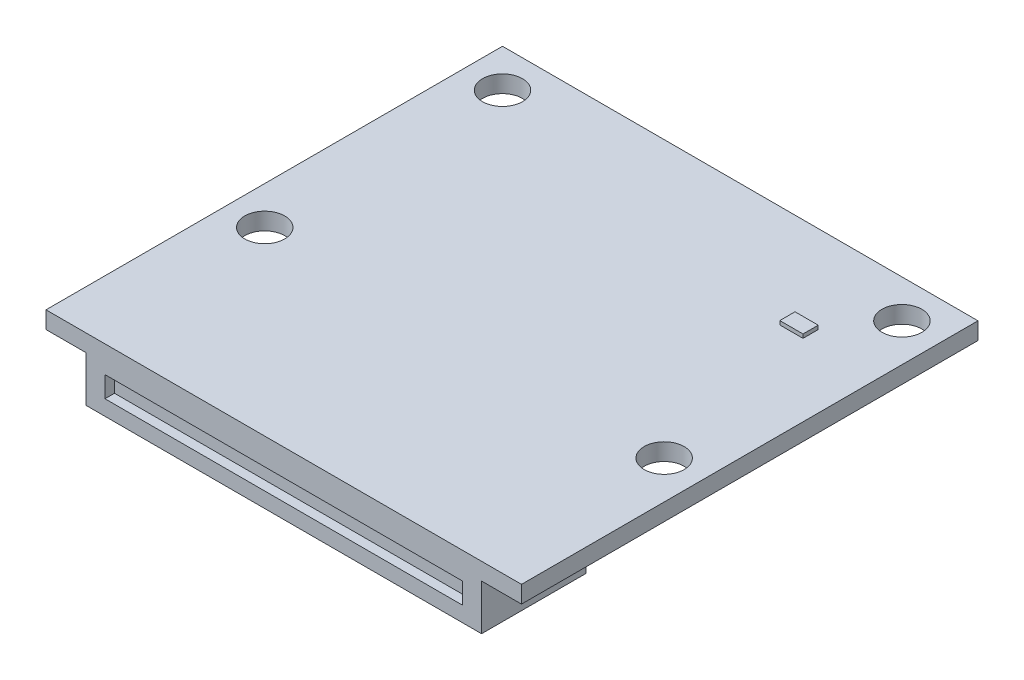
ISO-10303-21;
HEADER;
FILE_DESCRIPTION(('STEP AP214'),'2;1');
FILE_NAME('part.step','',(''),(''),'','','');
FILE_SCHEMA(('AUTOMOTIVE_DESIGN { 1 0 10303 214 1 1 1 1 }'));
ENDSEC;
DATA;
#1=APPLICATION_CONTEXT('core data for automotive mechanical design processes');
#2=APPLICATION_PROTOCOL_DEFINITION('international standard','automotive_design',2000,#1);
#3=PRODUCT_CONTEXT('',#1,'mechanical');
#4=PRODUCT('Part','Part','',(#3));
#5=PRODUCT_RELATED_PRODUCT_CATEGORY('part','',(#4));
#6=PRODUCT_DEFINITION_FORMATION('','',#4);
#7=PRODUCT_DEFINITION_CONTEXT('part definition',#1,'design');
#8=PRODUCT_DEFINITION('design','',#6,#7);
#9=PRODUCT_DEFINITION_SHAPE('','',#8);
#10=(LENGTH_UNIT() NAMED_UNIT(*) SI_UNIT(.MILLI.,.METRE.));
#11=(NAMED_UNIT(*) PLANE_ANGLE_UNIT() SI_UNIT($,.RADIAN.));
#12=(NAMED_UNIT(*) SI_UNIT($,.STERADIAN.) SOLID_ANGLE_UNIT());
#13=UNCERTAINTY_MEASURE_WITH_UNIT(LENGTH_MEASURE(1.E-05),#10,'distance_accuracy_value','');
#14=(GEOMETRIC_REPRESENTATION_CONTEXT(3) GLOBAL_UNCERTAINTY_ASSIGNED_CONTEXT((#13)) GLOBAL_UNIT_ASSIGNED_CONTEXT((#10,
#11,#12)) REPRESENTATION_CONTEXT('',''));
#15=CARTESIAN_POINT('',(0.,0.,0.));
#16=DIRECTION('',(0.,0.,1.));
#17=DIRECTION('',(1.,0.,0.));
#18=AXIS2_PLACEMENT_3D('',#15,#16,#17);
#19=CARTESIAN_POINT('',(0.,0.,0.));
#20=DIRECTION('',(0.,1.,0.));
#21=DIRECTION('',(0.,0.,1.));
#22=AXIS2_PLACEMENT_3D('',#19,#20,#21);
#23=PLANE('',#22);
#24=DIRECTION('',(0.,0.,1.));
#25=VECTOR('',#24,1.);
#26=CARTESIAN_POINT('',(-12.5,0.,-14.5));
#27=LINE('',#26,#25);
#28=CARTESIAN_POINT('',(-12.5,0.,-14.5));
#29=VERTEX_POINT('',#28);
#30=CARTESIAN_POINT('',(-12.5,0.,9.5));
#31=VERTEX_POINT('',#30);
#32=EDGE_CURVE('E272',#29,#31,#27,.T.);
#33=ORIENTED_EDGE('',*,*,#32,.T.);
#34=DIRECTION('',(1.,0.,0.));
#35=VECTOR('',#34,1.);
#36=CARTESIAN_POINT('',(-12.5,0.,9.5));
#37=LINE('',#36,#35);
#38=CARTESIAN_POINT('',(12.5,0.,9.5));
#39=VERTEX_POINT('',#38);
#40=EDGE_CURVE('E275',#31,#39,#37,.T.);
#41=ORIENTED_EDGE('',*,*,#40,.T.);
#42=DIRECTION('',(0.,0.,-1.));
#43=VECTOR('',#42,1.);
#44=CARTESIAN_POINT('',(12.5,0.,-14.5));
#45=LINE('',#44,#43);
#46=CARTESIAN_POINT('',(12.5,0.,-14.5));
#47=VERTEX_POINT('',#46);
#48=EDGE_CURVE('E279',#39,#47,#45,.T.);
#49=ORIENTED_EDGE('',*,*,#48,.T.);
#50=DIRECTION('',(-1.,0.,0.));
#51=VECTOR('',#50,1.);
#52=CARTESIAN_POINT('',(-12.5,0.,-14.5));
#53=LINE('',#52,#51);
#54=EDGE_CURVE('E282',#47,#29,#53,.T.);
#55=ORIENTED_EDGE('',*,*,#54,.T.);
#56=EDGE_LOOP('',(#33,#41,#49,#55));
#57=FACE_BOUND('',#56,.T.);
#58=CARTESIAN_POINT('',(10.5,0.,-12.5));
#59=DIRECTION('',(0.,1.,0.));
#60=DIRECTION('',(0.,0.,1.));
#61=AXIS2_PLACEMENT_3D('',#58,#59,#60);
#62=CIRCLE('',#61,1.05);
#63=CARTESIAN_POINT('',(10.5,0.,-11.45));
#64=VERTEX_POINT('',#63);
#65=EDGE_CURVE('E334',#64,#64,#62,.T.);
#66=ORIENTED_EDGE('',*,*,#65,.F.);
#67=EDGE_LOOP('',(#66));
#68=FACE_BOUND('',#67,.T.);
#69=CARTESIAN_POINT('',(10.5,0.,0.));
#70=DIRECTION('',(0.,1.,0.));
#71=DIRECTION('',(0.,0.,1.));
#72=AXIS2_PLACEMENT_3D('',#69,#70,#71);
#73=CIRCLE('',#72,1.05);
#74=CARTESIAN_POINT('',(10.5,0.,1.05));
#75=VERTEX_POINT('',#74);
#76=EDGE_CURVE('E328',#75,#75,#73,.T.);
#77=ORIENTED_EDGE('',*,*,#76,.F.);
#78=EDGE_LOOP('',(#77));
#79=FACE_BOUND('',#78,.T.);
#80=CARTESIAN_POINT('',(-10.5,0.,0.));
#81=DIRECTION('',(0.,1.,0.));
#82=DIRECTION('',(0.,0.,-1.));
#83=AXIS2_PLACEMENT_3D('',#80,#81,#82);
#84=CIRCLE('',#83,1.05);
#85=CARTESIAN_POINT('',(-10.5,0.,-1.05));
#86=VERTEX_POINT('',#85);
#87=EDGE_CURVE('E323',#86,#86,#84,.T.);
#88=ORIENTED_EDGE('',*,*,#87,.F.);
#89=EDGE_LOOP('',(#88));
#90=FACE_BOUND('',#89,.T.);
#91=CARTESIAN_POINT('',(-10.5,0.,-12.5));
#92=DIRECTION('',(0.,1.,0.));
#93=DIRECTION('',(0.,0.,-1.));
#94=AXIS2_PLACEMENT_3D('',#91,#92,#93);
#95=CIRCLE('',#94,1.05);
#96=CARTESIAN_POINT('',(-10.5,0.,-13.55));
#97=VERTEX_POINT('',#96);
#98=EDGE_CURVE('E317',#97,#97,#95,.T.);
#99=ORIENTED_EDGE('',*,*,#98,.F.);
#100=EDGE_LOOP('',(#99));
#101=FACE_BOUND('',#100,.T.);
#102=DIRECTION('',(-1.,0.,0.));
#103=VECTOR('',#102,1.);
#104=CARTESIAN_POINT('',(8.7,0.,-9.9));
#105=LINE('',#104,#103);
#106=CARTESIAN_POINT('',(8.7,0.,-9.9));
#107=VERTEX_POINT('',#106);
#108=CARTESIAN_POINT('',(7.48,0.,-9.9));
#109=VERTEX_POINT('',#108);
#110=EDGE_CURVE('E201',#107,#109,#105,.T.);
#111=ORIENTED_EDGE('',*,*,#110,.F.);
#112=DIRECTION('',(0.,0.,-1.));
#113=VECTOR('',#112,1.);
#114=CARTESIAN_POINT('',(8.7,0.,-9.1));
#115=LINE('',#114,#113);
#116=CARTESIAN_POINT('',(8.7,0.,-9.1));
#117=VERTEX_POINT('',#116);
#118=EDGE_CURVE('E184',#117,#107,#115,.T.);
#119=ORIENTED_EDGE('',*,*,#118,.F.);
#120=DIRECTION('',(1.,0.,0.));
#121=VECTOR('',#120,1.);
#122=CARTESIAN_POINT('',(8.7,0.,-9.1));
#123=LINE('',#122,#121);
#124=CARTESIAN_POINT('',(7.48,0.,-9.1));
#125=VERTEX_POINT('',#124);
#126=EDGE_CURVE('E192',#125,#117,#123,.T.);
#127=ORIENTED_EDGE('',*,*,#126,.F.);
#128=DIRECTION('',(0.,0.,1.));
#129=VECTOR('',#128,1.);
#130=CARTESIAN_POINT('',(7.48,0.,-9.1));
#131=LINE('',#130,#129);
#132=EDGE_CURVE('E203',#109,#125,#131,.T.);
#133=ORIENTED_EDGE('',*,*,#132,.F.);
#134=EDGE_LOOP('',(#111,#119,#127,#133));
#135=FACE_BOUND('',#134,.T.);
#136=ADVANCED_FACE('F34',(#57,#68,#79,#90,#101,#135),#23,.T.);
#137=CARTESIAN_POINT('',(0.,-0.9,0.));
#138=DIRECTION('',(0.,1.,0.));
#139=DIRECTION('',(0.,0.,1.));
#140=AXIS2_PLACEMENT_3D('',#137,#138,#139);
#141=PLANE('',#140);
#142=CARTESIAN_POINT('',(10.5,-0.9,-12.5));
#143=DIRECTION('',(0.,1.,0.));
#144=DIRECTION('',(0.,0.,1.));
#145=AXIS2_PLACEMENT_3D('',#142,#143,#144);
#146=CIRCLE('',#145,1.05);
#147=CARTESIAN_POINT('',(10.5,-0.9,-11.45));
#148=VERTEX_POINT('',#147);
#149=EDGE_CURVE('E276',#148,#148,#146,.T.);
#150=ORIENTED_EDGE('',*,*,#149,.T.);
#151=EDGE_LOOP('',(#150));
#152=FACE_BOUND('',#151,.T.);
#153=CARTESIAN_POINT('',(10.5,-0.9,0.));
#154=DIRECTION('',(0.,1.,0.));
#155=DIRECTION('',(0.,0.,1.));
#156=AXIS2_PLACEMENT_3D('',#153,#154,#155);
#157=CIRCLE('',#156,1.05);
#158=CARTESIAN_POINT('',(10.5,-0.9,1.05));
#159=VERTEX_POINT('',#158);
#160=EDGE_CURVE('E331',#159,#159,#157,.T.);
#161=ORIENTED_EDGE('',*,*,#160,.T.);
#162=EDGE_LOOP('',(#161));
#163=FACE_BOUND('',#162,.T.);
#164=CARTESIAN_POINT('',(-10.5,-0.9,0.));
#165=DIRECTION('',(0.,1.,0.));
#166=DIRECTION('',(0.,0.,-1.));
#167=AXIS2_PLACEMENT_3D('',#164,#165,#166);
#168=CIRCLE('',#167,1.05);
#169=CARTESIAN_POINT('',(-10.5,-0.9,-1.05));
#170=VERTEX_POINT('',#169);
#171=EDGE_CURVE('E325',#170,#170,#168,.T.);
#172=ORIENTED_EDGE('',*,*,#171,.T.);
#173=EDGE_LOOP('',(#172));
#174=FACE_BOUND('',#173,.T.);
#175=CARTESIAN_POINT('',(-10.5,-0.9,-12.5));
#176=DIRECTION('',(0.,1.,0.));
#177=DIRECTION('',(0.,0.,-1.));
#178=AXIS2_PLACEMENT_3D('',#175,#176,#177);
#179=CIRCLE('',#178,1.05);
#180=CARTESIAN_POINT('',(-10.5,-0.9,-13.55));
#181=VERTEX_POINT('',#180);
#182=EDGE_CURVE('E319',#181,#181,#179,.T.);
#183=ORIENTED_EDGE('',*,*,#182,.T.);
#184=EDGE_LOOP('',(#183));
#185=FACE_BOUND('',#184,.T.);
#186=DIRECTION('',(0.,0.,-1.));
#187=VECTOR('',#186,1.);
#188=CARTESIAN_POINT('',(-10.4,-0.9,9.5));
#189=LINE('',#188,#187);
#190=CARTESIAN_POINT('',(-10.4,-0.9,9.5));
#191=VERTEX_POINT('',#190);
#192=CARTESIAN_POINT('',(-10.4,-0.9,4.));
#193=VERTEX_POINT('',#192);
#194=EDGE_CURVE('E214',#191,#193,#189,.T.);
#195=ORIENTED_EDGE('',*,*,#194,.F.);
#196=DIRECTION('',(1.,0.,0.));
#197=VECTOR('',#196,1.);
#198=CARTESIAN_POINT('',(-12.5,-0.9,9.5));
#199=LINE('',#198,#197);
#200=CARTESIAN_POINT('',(-12.5,-0.9,9.5));
#201=VERTEX_POINT('',#200);
#202=EDGE_CURVE('E257',#201,#191,#199,.T.);
#203=ORIENTED_EDGE('',*,*,#202,.F.);
#204=DIRECTION('',(0.,0.,1.));
#205=VECTOR('',#204,1.);
#206=CARTESIAN_POINT('',(-12.5,-0.9,-14.5));
#207=LINE('',#206,#205);
#208=CARTESIAN_POINT('',(-12.5,-0.9,-14.5));
#209=VERTEX_POINT('',#208);
#210=EDGE_CURVE('E258',#209,#201,#207,.T.);
#211=ORIENTED_EDGE('',*,*,#210,.F.);
#212=DIRECTION('',(-1.,0.,0.));
#213=VECTOR('',#212,1.);
#214=CARTESIAN_POINT('',(-12.5,-0.9,-14.5));
#215=LINE('',#214,#213);
#216=CARTESIAN_POINT('',(12.5,-0.9,-14.5));
#217=VERTEX_POINT('',#216);
#218=EDGE_CURVE('E268',#217,#209,#215,.T.);
#219=ORIENTED_EDGE('',*,*,#218,.F.);
#220=DIRECTION('',(0.,0.,-1.));
#221=VECTOR('',#220,1.);
#222=CARTESIAN_POINT('',(12.5,-0.9,-14.5));
#223=LINE('',#222,#221);
#224=CARTESIAN_POINT('',(12.5,-0.9,9.5));
#225=VERTEX_POINT('',#224);
#226=EDGE_CURVE('E264',#225,#217,#223,.T.);
#227=ORIENTED_EDGE('',*,*,#226,.F.);
#228=CARTESIAN_POINT('',(10.4,-0.9,9.5));
#229=VERTEX_POINT('',#228);
#230=EDGE_CURVE('E254',#229,#225,#199,.T.);
#231=ORIENTED_EDGE('',*,*,#230,.F.);
#232=DIRECTION('',(0.,0.,1.));
#233=VECTOR('',#232,1.);
#234=CARTESIAN_POINT('',(10.4,-0.9,9.5));
#235=LINE('',#234,#233);
#236=CARTESIAN_POINT('',(10.4,-0.9,4.));
#237=VERTEX_POINT('',#236);
#238=EDGE_CURVE('E219',#237,#229,#235,.T.);
#239=ORIENTED_EDGE('',*,*,#238,.F.);
#240=DIRECTION('',(1.,0.,0.));
#241=VECTOR('',#240,1.);
#242=CARTESIAN_POINT('',(-10.4,-0.9,4.));
#243=LINE('',#242,#241);
#244=EDGE_CURVE('E226',#193,#237,#243,.T.);
#245=ORIENTED_EDGE('',*,*,#244,.F.);
#246=EDGE_LOOP('',(#195,#203,#211,#219,#227,#231,#239,#245));
#247=FACE_BOUND('',#246,.T.);
#248=ADVANCED_FACE('F304',(#152,#163,#174,#185,#247),#141,.F.);
#249=CARTESIAN_POINT('',(-12.5,-0.9,-14.5));
#250=DIRECTION('',(-1.,0.,0.));
#251=DIRECTION('',(0.,0.,1.));
#252=AXIS2_PLACEMENT_3D('',#249,#250,#251);
#253=PLANE('',#252);
#254=ORIENTED_EDGE('',*,*,#32,.F.);
#255=DIRECTION('',(0.,1.,0.));
#256=VECTOR('',#255,1.);
#257=CARTESIAN_POINT('',(-12.5,-0.9,-14.5));
#258=LINE('',#257,#256);
#259=EDGE_CURVE('E11',#209,#29,#258,.T.);
#260=ORIENTED_EDGE('',*,*,#259,.F.);
#261=ORIENTED_EDGE('',*,*,#210,.T.);
#262=DIRECTION('',(0.,1.,0.));
#263=VECTOR('',#262,1.);
#264=CARTESIAN_POINT('',(-12.5,-0.9,9.5));
#265=LINE('',#264,#263);
#266=EDGE_CURVE('E271',#201,#31,#265,.T.);
#267=ORIENTED_EDGE('',*,*,#266,.T.);
#268=EDGE_LOOP('',(#254,#260,#261,#267));
#269=FACE_BOUND('',#268,.T.);
#270=ADVANCED_FACE('F36',(#269),#253,.T.);
#271=CARTESIAN_POINT('',(-12.5,-0.9,-14.5));
#272=DIRECTION('',(0.,0.,-1.));
#273=DIRECTION('',(-1.,0.,0.));
#274=AXIS2_PLACEMENT_3D('',#271,#272,#273);
#275=PLANE('',#274);
#276=ORIENTED_EDGE('',*,*,#54,.F.);
#277=DIRECTION('',(0.,1.,0.));
#278=VECTOR('',#277,1.);
#279=CARTESIAN_POINT('',(12.5,-0.9,-14.5));
#280=LINE('',#279,#278);
#281=EDGE_CURVE('E43',#217,#47,#280,.T.);
#282=ORIENTED_EDGE('',*,*,#281,.F.);
#283=ORIENTED_EDGE('',*,*,#218,.T.);
#284=ORIENTED_EDGE('',*,*,#259,.T.);
#285=EDGE_LOOP('',(#276,#282,#283,#284));
#286=FACE_BOUND('',#285,.T.);
#287=ADVANCED_FACE('F301',(#286),#275,.T.);
#288=CARTESIAN_POINT('',(12.5,-0.9,-14.5));
#289=DIRECTION('',(1.,0.,0.));
#290=DIRECTION('',(0.,0.,-1.));
#291=AXIS2_PLACEMENT_3D('',#288,#289,#290);
#292=PLANE('',#291);
#293=ORIENTED_EDGE('',*,*,#48,.F.);
#294=DIRECTION('',(0.,1.,0.));
#295=VECTOR('',#294,1.);
#296=CARTESIAN_POINT('',(12.5,-0.9,9.5));
#297=LINE('',#296,#295);
#298=EDGE_CURVE('E286',#225,#39,#297,.T.);
#299=ORIENTED_EDGE('',*,*,#298,.F.);
#300=ORIENTED_EDGE('',*,*,#226,.T.);
#301=ORIENTED_EDGE('',*,*,#281,.T.);
#302=EDGE_LOOP('',(#293,#299,#300,#301));
#303=FACE_BOUND('',#302,.T.);
#304=ADVANCED_FACE('F411',(#303),#292,.T.);
#305=CARTESIAN_POINT('',(-12.5,-0.9,9.5));
#306=DIRECTION('',(0.,0.,1.));
#307=DIRECTION('',(1.,0.,0.));
#308=AXIS2_PLACEMENT_3D('',#305,#306,#307);
#309=PLANE('',#308);
#310=DIRECTION('',(0.,-1.,0.));
#311=VECTOR('',#310,1.);
#312=CARTESIAN_POINT('',(-9.4,-1.4,9.5));
#313=LINE('',#312,#311);
#314=CARTESIAN_POINT('',(-9.4,-1.4,9.5));
#315=VERTEX_POINT('',#314);
#316=CARTESIAN_POINT('',(-9.4,-2.5,9.5));
#317=VERTEX_POINT('',#316);
#318=EDGE_CURVE('E51',#315,#317,#313,.T.);
#319=ORIENTED_EDGE('',*,*,#318,.F.);
#320=DIRECTION('',(-1.,0.,0.));
#321=VECTOR('',#320,1.);
#322=CARTESIAN_POINT('',(-9.4,-1.4,9.5));
#323=LINE('',#322,#321);
#324=CARTESIAN_POINT('',(9.4,-1.4,9.5));
#325=VERTEX_POINT('',#324);
#326=EDGE_CURVE('E169',#325,#315,#323,.T.);
#327=ORIENTED_EDGE('',*,*,#326,.F.);
#328=DIRECTION('',(0.,1.,0.));
#329=VECTOR('',#328,1.);
#330=CARTESIAN_POINT('',(9.4,-1.4,9.5));
#331=LINE('',#330,#329);
#332=CARTESIAN_POINT('',(9.4,-2.5,9.5));
#333=VERTEX_POINT('',#332);
#334=EDGE_CURVE('E172',#333,#325,#331,.T.);
#335=ORIENTED_EDGE('',*,*,#334,.F.);
#336=DIRECTION('',(1.,0.,0.));
#337=VECTOR('',#336,1.);
#338=CARTESIAN_POINT('',(-9.4,-2.5,9.5));
#339=LINE('',#338,#337);
#340=EDGE_CURVE('E178',#317,#333,#339,.T.);
#341=ORIENTED_EDGE('',*,*,#340,.F.);
#342=EDGE_LOOP('',(#319,#327,#335,#341));
#343=FACE_BOUND('',#342,.T.);
#344=ORIENTED_EDGE('',*,*,#40,.F.);
#345=ORIENTED_EDGE('',*,*,#266,.F.);
#346=ORIENTED_EDGE('',*,*,#202,.T.);
#347=DIRECTION('',(0.,1.,0.));
#348=VECTOR('',#347,1.);
#349=CARTESIAN_POINT('',(-10.4,-3.3,9.5));
#350=LINE('',#349,#348);
#351=CARTESIAN_POINT('',(-10.4,-3.3,9.5));
#352=VERTEX_POINT('',#351);
#353=EDGE_CURVE('E225',#352,#191,#350,.T.);
#354=ORIENTED_EDGE('',*,*,#353,.F.);
#355=DIRECTION('',(-1.,0.,0.));
#356=VECTOR('',#355,1.);
#357=CARTESIAN_POINT('',(-10.4,-3.3,9.5));
#358=LINE('',#357,#356);
#359=CARTESIAN_POINT('',(10.4,-3.3,9.5));
#360=VERTEX_POINT('',#359);
#361=EDGE_CURVE('E223',#360,#352,#358,.T.);
#362=ORIENTED_EDGE('',*,*,#361,.F.);
#363=DIRECTION('',(0.,1.,0.));
#364=VECTOR('',#363,1.);
#365=CARTESIAN_POINT('',(10.4,-3.3,9.5));
#366=LINE('',#365,#364);
#367=EDGE_CURVE('E238',#360,#229,#366,.T.);
#368=ORIENTED_EDGE('',*,*,#367,.T.);
#369=ORIENTED_EDGE('',*,*,#230,.T.);
#370=ORIENTED_EDGE('',*,*,#298,.T.);
#371=EDGE_LOOP('',(#344,#345,#346,#354,#362,#368,#369,#370));
#372=FACE_BOUND('',#371,.T.);
#373=ADVANCED_FACE('F294',(#343,#372),#309,.T.);
#374=CARTESIAN_POINT('',(10.5,-0.9,-12.5));
#375=DIRECTION('',(0.,1.,0.));
#376=DIRECTION('',(0.,0.,1.));
#377=AXIS2_PLACEMENT_3D('',#374,#375,#376);
#378=CYLINDRICAL_SURFACE('',#377,1.05);
#379=ORIENTED_EDGE('',*,*,#149,.F.);
#380=EDGE_LOOP('',(#379));
#381=FACE_BOUND('',#380,.T.);
#382=ORIENTED_EDGE('',*,*,#65,.T.);
#383=EDGE_LOOP('',(#382));
#384=FACE_BOUND('',#383,.T.);
#385=ADVANCED_FACE('F341',(#381,#384),#378,.F.);
#386=CARTESIAN_POINT('',(10.5,-0.9,0.));
#387=DIRECTION('',(0.,1.,0.));
#388=DIRECTION('',(0.,0.,1.));
#389=AXIS2_PLACEMENT_3D('',#386,#387,#388);
#390=CYLINDRICAL_SURFACE('',#389,1.05);
#391=ORIENTED_EDGE('',*,*,#160,.F.);
#392=EDGE_LOOP('',(#391));
#393=FACE_BOUND('',#392,.T.);
#394=ORIENTED_EDGE('',*,*,#76,.T.);
#395=EDGE_LOOP('',(#394));
#396=FACE_BOUND('',#395,.T.);
#397=ADVANCED_FACE('F398',(#393,#396),#390,.F.);
#398=CARTESIAN_POINT('',(-10.5,-0.9,0.));
#399=DIRECTION('',(0.,1.,0.));
#400=DIRECTION('',(0.,0.,1.));
#401=AXIS2_PLACEMENT_3D('',#398,#399,#400);
#402=CYLINDRICAL_SURFACE('',#401,1.05);
#403=ORIENTED_EDGE('',*,*,#171,.F.);
#404=EDGE_LOOP('',(#403));
#405=FACE_BOUND('',#404,.T.);
#406=ORIENTED_EDGE('',*,*,#87,.T.);
#407=EDGE_LOOP('',(#406));
#408=FACE_BOUND('',#407,.T.);
#409=ADVANCED_FACE('F394',(#405,#408),#402,.F.);
#410=CARTESIAN_POINT('',(-10.5,-0.9,-12.5));
#411=DIRECTION('',(0.,1.,0.));
#412=DIRECTION('',(0.,0.,1.));
#413=AXIS2_PLACEMENT_3D('',#410,#411,#412);
#414=CYLINDRICAL_SURFACE('',#413,1.05);
#415=ORIENTED_EDGE('',*,*,#182,.F.);
#416=EDGE_LOOP('',(#415));
#417=FACE_BOUND('',#416,.T.);
#418=ORIENTED_EDGE('',*,*,#98,.T.);
#419=EDGE_LOOP('',(#418));
#420=FACE_BOUND('',#419,.T.);
#421=ADVANCED_FACE('F391',(#417,#420),#414,.F.);
#422=CARTESIAN_POINT('',(-10.4,-3.3,9.5));
#423=DIRECTION('',(1.,0.,0.));
#424=DIRECTION('',(0.,0.,-1.));
#425=AXIS2_PLACEMENT_3D('',#422,#423,#424);
#426=PLANE('',#425);
#427=ORIENTED_EDGE('',*,*,#194,.T.);
#428=DIRECTION('',(0.,1.,0.));
#429=VECTOR('',#428,1.);
#430=CARTESIAN_POINT('',(-10.4,-3.3,4.));
#431=LINE('',#430,#429);
#432=CARTESIAN_POINT('',(-10.4,-3.3,4.));
#433=VERTEX_POINT('',#432);
#434=EDGE_CURVE('E244',#433,#193,#431,.T.);
#435=ORIENTED_EDGE('',*,*,#434,.F.);
#436=DIRECTION('',(0.,0.,-1.));
#437=VECTOR('',#436,1.);
#438=CARTESIAN_POINT('',(-10.4,-3.3,9.5));
#439=LINE('',#438,#437);
#440=EDGE_CURVE('E215',#352,#433,#439,.T.);
#441=ORIENTED_EDGE('',*,*,#440,.F.);
#442=ORIENTED_EDGE('',*,*,#353,.T.);
#443=EDGE_LOOP('',(#427,#435,#441,#442));
#444=FACE_BOUND('',#443,.T.);
#445=ADVANCED_FACE('F307',(#444),#426,.F.);
#446=CARTESIAN_POINT('',(-10.4,-3.3,4.));
#447=DIRECTION('',(0.,0.,1.));
#448=DIRECTION('',(1.,0.,0.));
#449=AXIS2_PLACEMENT_3D('',#446,#447,#448);
#450=PLANE('',#449);
#451=ORIENTED_EDGE('',*,*,#244,.T.);
#452=DIRECTION('',(0.,1.,0.));
#453=VECTOR('',#452,1.);
#454=CARTESIAN_POINT('',(10.4,-3.3,4.));
#455=LINE('',#454,#453);
#456=CARTESIAN_POINT('',(10.4,-3.3,4.));
#457=VERTEX_POINT('',#456);
#458=EDGE_CURVE('E231',#457,#237,#455,.T.);
#459=ORIENTED_EDGE('',*,*,#458,.F.);
#460=DIRECTION('',(1.,0.,0.));
#461=VECTOR('',#460,1.);
#462=CARTESIAN_POINT('',(-10.4,-3.3,4.));
#463=LINE('',#462,#461);
#464=EDGE_CURVE('E218',#433,#457,#463,.T.);
#465=ORIENTED_EDGE('',*,*,#464,.F.);
#466=ORIENTED_EDGE('',*,*,#434,.T.);
#467=EDGE_LOOP('',(#451,#459,#465,#466));
#468=FACE_BOUND('',#467,.T.);
#469=ADVANCED_FACE('F316',(#468),#450,.F.);
#470=CARTESIAN_POINT('',(10.4,-3.3,9.5));
#471=DIRECTION('',(-1.,0.,0.));
#472=DIRECTION('',(0.,0.,1.));
#473=AXIS2_PLACEMENT_3D('',#470,#471,#472);
#474=PLANE('',#473);
#475=ORIENTED_EDGE('',*,*,#238,.T.);
#476=ORIENTED_EDGE('',*,*,#367,.F.);
#477=DIRECTION('',(0.,0.,1.));
#478=VECTOR('',#477,1.);
#479=CARTESIAN_POINT('',(10.4,-3.3,9.5));
#480=LINE('',#479,#478);
#481=EDGE_CURVE('E221',#457,#360,#480,.T.);
#482=ORIENTED_EDGE('',*,*,#481,.F.);
#483=ORIENTED_EDGE('',*,*,#458,.T.);
#484=EDGE_LOOP('',(#475,#476,#482,#483));
#485=FACE_BOUND('',#484,.T.);
#486=ADVANCED_FACE('F314',(#485),#474,.F.);
#487=CARTESIAN_POINT('',(0.,-3.3,0.));
#488=DIRECTION('',(0.,-1.,0.));
#489=DIRECTION('',(0.,0.,-1.));
#490=AXIS2_PLACEMENT_3D('',#487,#488,#489);
#491=PLANE('',#490);
#492=ORIENTED_EDGE('',*,*,#440,.T.);
#493=ORIENTED_EDGE('',*,*,#464,.T.);
#494=ORIENTED_EDGE('',*,*,#481,.T.);
#495=ORIENTED_EDGE('',*,*,#361,.T.);
#496=EDGE_LOOP('',(#492,#493,#494,#495));
#497=FACE_BOUND('',#496,.T.);
#498=ADVANCED_FACE('F310',(#497),#491,.T.);
#499=CARTESIAN_POINT('',(8.7,0.2,-9.1));
#500=DIRECTION('',(-1.,0.,0.));
#501=DIRECTION('',(0.,0.,1.));
#502=AXIS2_PLACEMENT_3D('',#499,#500,#501);
#503=PLANE('',#502);
#504=ORIENTED_EDGE('',*,*,#118,.T.);
#505=DIRECTION('',(0.,-1.,0.));
#506=VECTOR('',#505,1.);
#507=CARTESIAN_POINT('',(8.7,0.2,-9.9));
#508=LINE('',#507,#506);
#509=CARTESIAN_POINT('',(8.7,0.2,-9.9));
#510=VERTEX_POINT('',#509);
#511=EDGE_CURVE('E212',#510,#107,#508,.T.);
#512=ORIENTED_EDGE('',*,*,#511,.F.);
#513=DIRECTION('',(0.,0.,-1.));
#514=VECTOR('',#513,1.);
#515=CARTESIAN_POINT('',(8.7,0.2,-9.1));
#516=LINE('',#515,#514);
#517=CARTESIAN_POINT('',(8.7,0.2,-9.1));
#518=VERTEX_POINT('',#517);
#519=EDGE_CURVE('E188',#518,#510,#516,.T.);
#520=ORIENTED_EDGE('',*,*,#519,.F.);
#521=DIRECTION('',(0.,-1.,0.));
#522=VECTOR('',#521,1.);
#523=CARTESIAN_POINT('',(8.7,0.2,-9.1));
#524=LINE('',#523,#522);
#525=EDGE_CURVE('E198',#518,#117,#524,.T.);
#526=ORIENTED_EDGE('',*,*,#525,.T.);
#527=EDGE_LOOP('',(#504,#512,#520,#526));
#528=FACE_BOUND('',#527,.T.);
#529=ADVANCED_FACE('F367',(#528),#503,.F.);
#530=CARTESIAN_POINT('',(8.7,0.2,-9.9));
#531=DIRECTION('',(0.,0.,1.));
#532=DIRECTION('',(1.,0.,0.));
#533=AXIS2_PLACEMENT_3D('',#530,#531,#532);
#534=PLANE('',#533);
#535=ORIENTED_EDGE('',*,*,#110,.T.);
#536=DIRECTION('',(0.,-1.,0.));
#537=VECTOR('',#536,1.);
#538=CARTESIAN_POINT('',(7.48,0.2,-9.9));
#539=LINE('',#538,#537);
#540=CARTESIAN_POINT('',(7.48,0.2,-9.9));
#541=VERTEX_POINT('',#540);
#542=EDGE_CURVE('E209',#541,#109,#539,.T.);
#543=ORIENTED_EDGE('',*,*,#542,.F.);
#544=DIRECTION('',(-1.,0.,0.));
#545=VECTOR('',#544,1.);
#546=CARTESIAN_POINT('',(8.7,0.2,-9.9));
#547=LINE('',#546,#545);
#548=EDGE_CURVE('E191',#510,#541,#547,.T.);
#549=ORIENTED_EDGE('',*,*,#548,.F.);
#550=ORIENTED_EDGE('',*,*,#511,.T.);
#551=EDGE_LOOP('',(#535,#543,#549,#550));
#552=FACE_BOUND('',#551,.T.);
#553=ADVANCED_FACE('F357',(#552),#534,.F.);
#554=CARTESIAN_POINT('',(7.48,0.2,-9.1));
#555=DIRECTION('',(1.,0.,0.));
#556=DIRECTION('',(0.,0.,-1.));
#557=AXIS2_PLACEMENT_3D('',#554,#555,#556);
#558=PLANE('',#557);
#559=ORIENTED_EDGE('',*,*,#132,.T.);
#560=DIRECTION('',(0.,-1.,0.));
#561=VECTOR('',#560,1.);
#562=CARTESIAN_POINT('',(7.48,0.2,-9.1));
#563=LINE('',#562,#561);
#564=CARTESIAN_POINT('',(7.48,0.2,-9.1));
#565=VERTEX_POINT('',#564);
#566=EDGE_CURVE('E59',#565,#125,#563,.T.);
#567=ORIENTED_EDGE('',*,*,#566,.F.);
#568=DIRECTION('',(0.,0.,1.));
#569=VECTOR('',#568,1.);
#570=CARTESIAN_POINT('',(7.48,0.2,-9.1));
#571=LINE('',#570,#569);
#572=EDGE_CURVE('E194',#541,#565,#571,.T.);
#573=ORIENTED_EDGE('',*,*,#572,.F.);
#574=ORIENTED_EDGE('',*,*,#542,.T.);
#575=EDGE_LOOP('',(#559,#567,#573,#574));
#576=FACE_BOUND('',#575,.T.);
#577=ADVANCED_FACE('F361',(#576),#558,.F.);
#578=CARTESIAN_POINT('',(8.7,0.2,-9.1));
#579=DIRECTION('',(0.,0.,-1.));
#580=DIRECTION('',(-1.,0.,0.));
#581=AXIS2_PLACEMENT_3D('',#578,#579,#580);
#582=PLANE('',#581);
#583=ORIENTED_EDGE('',*,*,#126,.T.);
#584=ORIENTED_EDGE('',*,*,#525,.F.);
#585=DIRECTION('',(1.,0.,0.));
#586=VECTOR('',#585,1.);
#587=CARTESIAN_POINT('',(8.7,0.2,-9.1));
#588=LINE('',#587,#586);
#589=EDGE_CURVE('E196',#565,#518,#588,.T.);
#590=ORIENTED_EDGE('',*,*,#589,.F.);
#591=ORIENTED_EDGE('',*,*,#566,.T.);
#592=EDGE_LOOP('',(#583,#584,#590,#591));
#593=FACE_BOUND('',#592,.T.);
#594=ADVANCED_FACE('F368',(#593),#582,.F.);
#595=CARTESIAN_POINT('',(0.,0.2,0.));
#596=DIRECTION('',(0.,1.,0.));
#597=DIRECTION('',(0.,0.,1.));
#598=AXIS2_PLACEMENT_3D('',#595,#596,#597);
#599=PLANE('',#598);
#600=ORIENTED_EDGE('',*,*,#519,.T.);
#601=ORIENTED_EDGE('',*,*,#548,.T.);
#602=ORIENTED_EDGE('',*,*,#572,.T.);
#603=ORIENTED_EDGE('',*,*,#589,.T.);
#604=EDGE_LOOP('',(#600,#601,#602,#603));
#605=FACE_BOUND('',#604,.T.);
#606=ADVANCED_FACE('F363',(#605),#599,.T.);
#607=CARTESIAN_POINT('',(-9.4,-1.4,9.));
#608=DIRECTION('',(-1.,0.,0.));
#609=DIRECTION('',(0.,0.,1.));
#610=AXIS2_PLACEMENT_3D('',#607,#608,#609);
#611=PLANE('',#610);
#612=ORIENTED_EDGE('',*,*,#318,.T.);
#613=DIRECTION('',(0.,0.,1.));
#614=VECTOR('',#613,1.);
#615=CARTESIAN_POINT('',(-9.4,-2.5,9.));
#616=LINE('',#615,#614);
#617=CARTESIAN_POINT('',(-9.4,-2.5,9.));
#618=VERTEX_POINT('',#617);
#619=EDGE_CURVE('E147',#618,#317,#616,.T.);
#620=ORIENTED_EDGE('',*,*,#619,.F.);
#621=DIRECTION('',(0.,-1.,0.));
#622=VECTOR('',#621,1.);
#623=CARTESIAN_POINT('',(-9.4,-1.4,9.));
#624=LINE('',#623,#622);
#625=CARTESIAN_POINT('',(-9.4,-1.4,9.));
#626=VERTEX_POINT('',#625);
#627=EDGE_CURVE('E151',#626,#618,#624,.T.);
#628=ORIENTED_EDGE('',*,*,#627,.F.);
#629=DIRECTION('',(0.,0.,1.));
#630=VECTOR('',#629,1.);
#631=CARTESIAN_POINT('',(-9.4,-1.4,9.));
#632=LINE('',#631,#630);
#633=EDGE_CURVE('E182',#626,#315,#632,.T.);
#634=ORIENTED_EDGE('',*,*,#633,.T.);
#635=EDGE_LOOP('',(#612,#620,#628,#634));
#636=FACE_BOUND('',#635,.T.);
#637=ADVANCED_FACE('F149',(#636),#611,.F.);
#638=CARTESIAN_POINT('',(-9.4,-1.4,9.));
#639=DIRECTION('',(0.,1.,0.));
#640=DIRECTION('',(0.,0.,1.));
#641=AXIS2_PLACEMENT_3D('',#638,#639,#640);
#642=PLANE('',#641);
#643=ORIENTED_EDGE('',*,*,#326,.T.);
#644=ORIENTED_EDGE('',*,*,#633,.F.);
#645=DIRECTION('',(-1.,0.,0.));
#646=VECTOR('',#645,1.);
#647=CARTESIAN_POINT('',(-9.4,-1.4,9.));
#648=LINE('',#647,#646);
#649=CARTESIAN_POINT('',(9.4,-1.4,9.));
#650=VERTEX_POINT('',#649);
#651=EDGE_CURVE('E157',#650,#626,#648,.T.);
#652=ORIENTED_EDGE('',*,*,#651,.F.);
#653=DIRECTION('',(0.,0.,1.));
#654=VECTOR('',#653,1.);
#655=CARTESIAN_POINT('',(9.4,-1.4,9.));
#656=LINE('',#655,#654);
#657=EDGE_CURVE('E185',#650,#325,#656,.T.);
#658=ORIENTED_EDGE('',*,*,#657,.T.);
#659=EDGE_LOOP('',(#643,#644,#652,#658));
#660=FACE_BOUND('',#659,.T.);
#661=ADVANCED_FACE('F423',(#660),#642,.F.);
#662=CARTESIAN_POINT('',(9.4,-1.4,9.));
#663=DIRECTION('',(1.,0.,0.));
#664=DIRECTION('',(0.,0.,-1.));
#665=AXIS2_PLACEMENT_3D('',#662,#663,#664);
#666=PLANE('',#665);
#667=ORIENTED_EDGE('',*,*,#334,.T.);
#668=ORIENTED_EDGE('',*,*,#657,.F.);
#669=DIRECTION('',(0.,1.,0.));
#670=VECTOR('',#669,1.);
#671=CARTESIAN_POINT('',(9.4,-1.4,9.));
#672=LINE('',#671,#670);
#673=CARTESIAN_POINT('',(9.4,-2.5,9.));
#674=VERTEX_POINT('',#673);
#675=EDGE_CURVE('E165',#674,#650,#672,.T.);
#676=ORIENTED_EDGE('',*,*,#675,.F.);
#677=DIRECTION('',(0.,0.,1.));
#678=VECTOR('',#677,1.);
#679=CARTESIAN_POINT('',(9.4,-2.5,9.));
#680=LINE('',#679,#678);
#681=EDGE_CURVE('E156',#674,#333,#680,.T.);
#682=ORIENTED_EDGE('',*,*,#681,.T.);
#683=EDGE_LOOP('',(#667,#668,#676,#682));
#684=FACE_BOUND('',#683,.T.);
#685=ADVANCED_FACE('F421',(#684),#666,.F.);
#686=CARTESIAN_POINT('',(-9.4,-2.5,9.));
#687=DIRECTION('',(0.,-1.,0.));
#688=DIRECTION('',(0.,0.,-1.));
#689=AXIS2_PLACEMENT_3D('',#686,#687,#688);
#690=PLANE('',#689);
#691=ORIENTED_EDGE('',*,*,#340,.T.);
#692=ORIENTED_EDGE('',*,*,#681,.F.);
#693=DIRECTION('',(1.,0.,0.));
#694=VECTOR('',#693,1.);
#695=CARTESIAN_POINT('',(-9.4,-2.5,9.));
#696=LINE('',#695,#694);
#697=EDGE_CURVE('E160',#618,#674,#696,.T.);
#698=ORIENTED_EDGE('',*,*,#697,.F.);
#699=ORIENTED_EDGE('',*,*,#619,.T.);
#700=EDGE_LOOP('',(#691,#692,#698,#699));
#701=FACE_BOUND('',#700,.T.);
#702=ADVANCED_FACE('F161',(#701),#690,.F.);
#703=CARTESIAN_POINT('',(0.,0.,9.));
#704=DIRECTION('',(0.,0.,1.));
#705=DIRECTION('',(1.,0.,0.));
#706=AXIS2_PLACEMENT_3D('',#703,#704,#705);
#707=PLANE('',#706);
#708=ORIENTED_EDGE('',*,*,#627,.T.);
#709=ORIENTED_EDGE('',*,*,#697,.T.);
#710=ORIENTED_EDGE('',*,*,#675,.T.);
#711=ORIENTED_EDGE('',*,*,#651,.T.);
#712=EDGE_LOOP('',(#708,#709,#710,#711));
#713=FACE_BOUND('',#712,.T.);
#714=ADVANCED_FACE('F167',(#713),#707,.T.);
#715=CLOSED_SHELL('',(#136,#248,#270,#287,#304,#373,#385,#397,#409,#421,#445,#469,#486,#498,
#529,#553,#577,#594,#606,#637,#661,#685,#702,#714));
#716=MANIFOLD_SOLID_BREP('B2',#715);
#717=ADVANCED_BREP_SHAPE_REPRESENTATION('',(#18,#716),#14);
#718=SHAPE_DEFINITION_REPRESENTATION(#9,#717);
ENDSEC;
END-ISO-10303-21;
